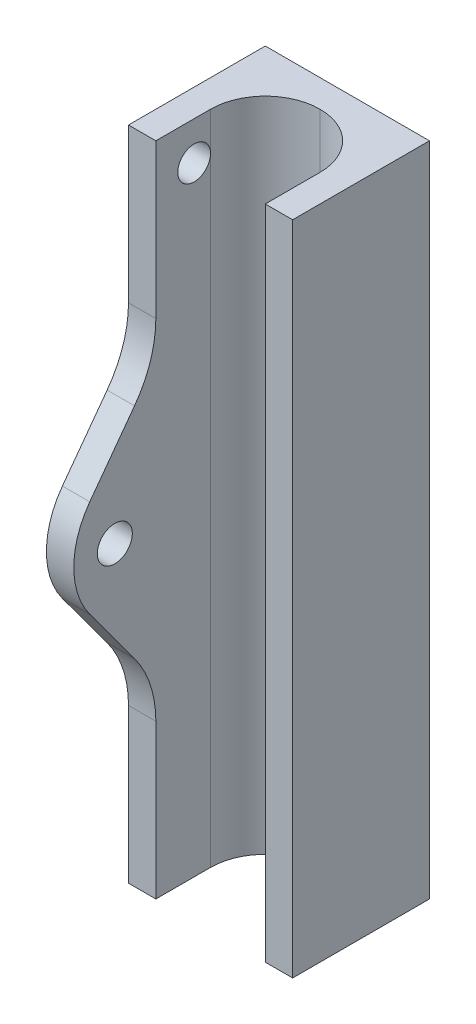
ISO-10303-21;
HEADER;
FILE_DESCRIPTION(('STEP AP214'),'2;1');
FILE_NAME('part.step','',(''),(''),'','','');
FILE_SCHEMA(('AUTOMOTIVE_DESIGN { 1 0 10303 214 1 1 1 1 }'));
ENDSEC;
DATA;
#1=APPLICATION_CONTEXT('core data for automotive mechanical design processes');
#2=APPLICATION_PROTOCOL_DEFINITION('international standard','automotive_design',2000,#1);
#3=PRODUCT_CONTEXT('',#1,'mechanical');
#4=PRODUCT('Part','Part','',(#3));
#5=PRODUCT_RELATED_PRODUCT_CATEGORY('part','',(#4));
#6=PRODUCT_DEFINITION_FORMATION('','',#4);
#7=PRODUCT_DEFINITION_CONTEXT('part definition',#1,'design');
#8=PRODUCT_DEFINITION('design','',#6,#7);
#9=PRODUCT_DEFINITION_SHAPE('','',#8);
#10=(LENGTH_UNIT() NAMED_UNIT(*) SI_UNIT(.MILLI.,.METRE.));
#11=(NAMED_UNIT(*) PLANE_ANGLE_UNIT() SI_UNIT($,.RADIAN.));
#12=(NAMED_UNIT(*) SI_UNIT($,.STERADIAN.) SOLID_ANGLE_UNIT());
#13=UNCERTAINTY_MEASURE_WITH_UNIT(LENGTH_MEASURE(1.E-05),#10,'distance_accuracy_value','');
#14=(GEOMETRIC_REPRESENTATION_CONTEXT(3) GLOBAL_UNCERTAINTY_ASSIGNED_CONTEXT((#13)) GLOBAL_UNIT_ASSIGNED_CONTEXT((#10,
#11,#12)) REPRESENTATION_CONTEXT('',''));
#15=CARTESIAN_POINT('',(0.,0.,0.));
#16=DIRECTION('',(0.,0.,1.));
#17=DIRECTION('',(1.,0.,0.));
#18=AXIS2_PLACEMENT_3D('',#15,#16,#17);
#19=CARTESIAN_POINT('',(-6.35,0.,12.7));
#20=DIRECTION('',(1.,0.,0.));
#21=DIRECTION('',(0.,0.,-1.));
#22=AXIS2_PLACEMENT_3D('',#19,#20,#21);
#23=PLANE('',#22);
#24=CARTESIAN_POINT('',(-6.35,0.,17.4625));
#25=DIRECTION('',(1.,0.,0.));
#26=DIRECTION('',(0.,0.,-1.));
#27=AXIS2_PLACEMENT_3D('',#24,#25,#26);
#28=CIRCLE('',#27,2.032);
#29=CARTESIAN_POINT('',(-6.35,0.,15.4305));
#30=VERTEX_POINT('',#29);
#31=EDGE_CURVE('E363',#30,#30,#28,.T.);
#32=ORIENTED_EDGE('',*,*,#31,.F.);
#33=EDGE_LOOP('',(#32));
#34=FACE_BOUND('',#33,.T.);
#35=DIRECTION('',(0.,-1.,0.));
#36=VECTOR('',#35,1.);
#37=CARTESIAN_POINT('',(-6.35,38.1,6.35));
#38=LINE('',#37,#36);
#39=CARTESIAN_POINT('',(-6.35,-38.1,6.35));
#40=VERTEX_POINT('',#39);
#41=CARTESIAN_POINT('',(-6.35,33.655,6.35));
#42=VERTEX_POINT('',#41);
#43=EDGE_CURVE('E465',#40,#42,#38,.F.);
#44=ORIENTED_EDGE('',*,*,#43,.T.);
#45=CARTESIAN_POINT('',(-6.35,33.655,8.255));
#46=DIRECTION('',(1.,0.,0.));
#47=DIRECTION('',(0.,0.,-1.));
#48=AXIS2_PLACEMENT_3D('',#45,#46,#47);
#49=CIRCLE('',#48,1.905);
#50=EDGE_CURVE('E213',#42,#42,#49,.F.);
#51=ORIENTED_EDGE('',*,*,#50,.T.);
#52=CARTESIAN_POINT('',(-6.35,38.1,6.35));
#53=VERTEX_POINT('',#52);
#54=EDGE_CURVE('E464',#42,#53,#38,.F.);
#55=ORIENTED_EDGE('',*,*,#54,.T.);
#56=DIRECTION('',(0.,0.,-1.));
#57=VECTOR('',#56,1.);
#58=CARTESIAN_POINT('',(-6.35,38.1,12.7));
#59=LINE('',#58,#57);
#60=CARTESIAN_POINT('',(-6.35000000000001,38.1,12.7));
#61=VERTEX_POINT('',#60);
#62=EDGE_CURVE('E461',#61,#53,#59,.T.);
#63=ORIENTED_EDGE('',*,*,#62,.F.);
#64=DIRECTION('',(0.,-1.,0.));
#65=VECTOR('',#64,1.);
#66=CARTESIAN_POINT('',(-6.35,0.,12.7));
#67=LINE('',#66,#65);
#68=CARTESIAN_POINT('',(-6.35000000000001,20.2324014238191,12.7));
#69=VERTEX_POINT('',#68);
#70=EDGE_CURVE('E403',#61,#69,#67,.T.);
#71=ORIENTED_EDGE('',*,*,#70,.T.);
#72=CARTESIAN_POINT('',(-6.35,20.2324014238191,25.4));
#73=DIRECTION('',(1.,0.,0.));
#74=DIRECTION('',(0.,0.,-1.));
#75=AXIS2_PLACEMENT_3D('',#72,#73,#74);
#76=CIRCLE('',#75,12.7);
#77=CARTESIAN_POINT('',(-6.35000000000001,12.7,15.1748873458309));
#78=VERTEX_POINT('',#77);
#79=EDGE_CURVE('E399',#69,#78,#76,.F.);
#80=ORIENTED_EDGE('',*,*,#79,.T.);
#81=DIRECTION('',(0.,0.805126980643237,-0.593102474316458));
#82=VECTOR('',#81,1.);
#83=CARTESIAN_POINT('',(-6.35,5.64930106786428,20.3688344906269));
#84=LINE('',#83,#82);
#85=CARTESIAN_POINT('',(-6.35000000000001,5.64930106786431,20.3688344906268));
#86=VERTEX_POINT('',#85);
#87=EDGE_CURVE('E407',#86,#78,#84,.T.);
#88=ORIENTED_EDGE('',*,*,#87,.F.);
#89=CARTESIAN_POINT('',(-6.35,0.,12.7));
#90=DIRECTION('',(1.,0.,0.));
#91=DIRECTION('',(0.,0.,-1.));
#92=AXIS2_PLACEMENT_3D('',#89,#90,#91);
#93=CIRCLE('',#92,9.525);
#94=CARTESIAN_POINT('',(-6.35000000000001,-5.64930106786427,20.3688344906268));
#95=VERTEX_POINT('',#94);
#96=EDGE_CURVE('E385',#86,#95,#93,.T.);
#97=ORIENTED_EDGE('',*,*,#96,.T.);
#98=DIRECTION('',(0.,-0.805126980643237,-0.593102474316458));
#99=VECTOR('',#98,1.);
#100=CARTESIAN_POINT('',(-6.35,-5.64930106786427,20.3688344906268));
#101=LINE('',#100,#99);
#102=CARTESIAN_POINT('',(-6.35000000000001,-12.7,15.1748873458309));
#103=VERTEX_POINT('',#102);
#104=EDGE_CURVE('E359',#95,#103,#101,.T.);
#105=ORIENTED_EDGE('',*,*,#104,.T.);
#106=CARTESIAN_POINT('',(-6.35,-20.232401423819,25.4));
#107=DIRECTION('',(1.,0.,0.));
#108=DIRECTION('',(0.,0.,-1.));
#109=AXIS2_PLACEMENT_3D('',#106,#107,#108);
#110=CIRCLE('',#109,12.7);
#111=CARTESIAN_POINT('',(-6.35000000000001,-20.232401423819,12.7));
#112=VERTEX_POINT('',#111);
#113=EDGE_CURVE('E348',#112,#103,#110,.T.);
#114=ORIENTED_EDGE('',*,*,#113,.F.);
#115=DIRECTION('',(0.,-1.,0.));
#116=VECTOR('',#115,1.);
#117=CARTESIAN_POINT('',(-6.35,0.,12.7));
#118=LINE('',#117,#116);
#119=CARTESIAN_POINT('',(-6.35000000000001,-38.1,12.7));
#120=VERTEX_POINT('',#119);
#121=EDGE_CURVE('E315',#112,#120,#118,.T.);
#122=ORIENTED_EDGE('',*,*,#121,.T.);
#123=DIRECTION('',(0.,0.,-1.));
#124=VECTOR('',#123,1.);
#125=CARTESIAN_POINT('',(-6.35,-38.1,12.7));
#126=LINE('',#125,#124);
#127=EDGE_CURVE('E450',#120,#40,#126,.T.);
#128=ORIENTED_EDGE('',*,*,#127,.T.);
#129=EDGE_LOOP('',(#44,#51,#55,#63,#71,#80,#88,#97,#105,#114,#122,#128));
#130=FACE_BOUND('',#129,.T.);
#131=ADVANCED_FACE('F198',(#34,#130),#23,.T.);
#132=CARTESIAN_POINT('',(-9.52500000000001,0.,12.7));
#133=DIRECTION('',(1.,0.,0.));
#134=DIRECTION('',(0.,1.,0.));
#135=AXIS2_PLACEMENT_3D('',#132,#133,#134);
#136=PLANE('',#135);
#137=CARTESIAN_POINT('',(-9.52500000000001,33.655,8.255));
#138=DIRECTION('',(-1.,0.,0.));
#139=DIRECTION('',(0.,-1.,0.));
#140=AXIS2_PLACEMENT_3D('',#137,#138,#139);
#141=CIRCLE('',#140,1.905);
#142=CARTESIAN_POINT('',(-9.52500000000001,31.75,8.255));
#143=VERTEX_POINT('',#142);
#144=EDGE_CURVE('E736',#143,#143,#141,.T.);
#145=ORIENTED_EDGE('',*,*,#144,.F.);
#146=EDGE_LOOP('',(#145));
#147=FACE_BOUND('',#146,.T.);
#148=CARTESIAN_POINT('',(-9.52500000000001,0.,17.4625));
#149=DIRECTION('',(1.,0.,0.));
#150=DIRECTION('',(0.,0.,-1.));
#151=AXIS2_PLACEMENT_3D('',#148,#149,#150);
#152=CIRCLE('',#151,2.032);
#153=CARTESIAN_POINT('',(-9.52500000000001,0.,15.4305));
#154=VERTEX_POINT('',#153);
#155=EDGE_CURVE('E336',#154,#154,#152,.T.);
#156=ORIENTED_EDGE('',*,*,#155,.T.);
#157=EDGE_LOOP('',(#156));
#158=FACE_BOUND('',#157,.T.);
#159=DIRECTION('',(0.,-1.,0.));
#160=VECTOR('',#159,1.);
#161=CARTESIAN_POINT('',(-9.52500000000001,0.,12.7));
#162=LINE('',#161,#160);
#163=CARTESIAN_POINT('',(-9.52500000000001,-20.232401423819,12.7));
#164=VERTEX_POINT('',#163);
#165=CARTESIAN_POINT('',(-9.52500000000001,-38.1,12.7));
#166=VERTEX_POINT('',#165);
#167=EDGE_CURVE('E312',#164,#166,#162,.T.);
#168=ORIENTED_EDGE('',*,*,#167,.F.);
#169=CARTESIAN_POINT('',(-9.52500000000001,-20.232401423819,25.4));
#170=DIRECTION('',(1.,0.,0.));
#171=DIRECTION('',(0.,0.,-1.));
#172=AXIS2_PLACEMENT_3D('',#169,#170,#171);
#173=CIRCLE('',#172,12.7);
#174=CARTESIAN_POINT('',(-9.52500000000001,-12.7,15.1748873458309));
#175=VERTEX_POINT('',#174);
#176=EDGE_CURVE('E324',#164,#175,#173,.T.);
#177=ORIENTED_EDGE('',*,*,#176,.T.);
#178=DIRECTION('',(0.,-0.805126980643237,-0.593102474316458));
#179=VECTOR('',#178,1.);
#180=CARTESIAN_POINT('',(-9.52500000000001,-11.7138406832165,15.901348568615));
#181=LINE('',#180,#179);
#182=CARTESIAN_POINT('',(-9.52500000000001,-5.64930106786427,20.3688344906268));
#183=VERTEX_POINT('',#182);
#184=EDGE_CURVE('E320',#183,#175,#181,.T.);
#185=ORIENTED_EDGE('',*,*,#184,.F.);
#186=CARTESIAN_POINT('',(-9.52500000000001,0.,12.7));
#187=DIRECTION('',(1.,0.,0.));
#188=DIRECTION('',(0.,0.,-1.));
#189=AXIS2_PLACEMENT_3D('',#186,#187,#188);
#190=CIRCLE('',#189,9.525);
#191=CARTESIAN_POINT('',(-9.52500000000001,5.64930106786431,20.3688344906268));
#192=VERTEX_POINT('',#191);
#193=EDGE_CURVE('E373',#192,#183,#190,.T.);
#194=ORIENTED_EDGE('',*,*,#193,.F.);
#195=DIRECTION('',(0.,0.805126980643237,-0.593102474316458));
#196=VECTOR('',#195,1.);
#197=CARTESIAN_POINT('',(-9.52500000000001,11.7138406832165,15.901348568615));
#198=LINE('',#197,#196);
#199=CARTESIAN_POINT('',(-9.52500000000001,12.7,15.1748873458309));
#200=VERTEX_POINT('',#199);
#201=EDGE_CURVE('E376',#192,#200,#198,.T.);
#202=ORIENTED_EDGE('',*,*,#201,.T.);
#203=CARTESIAN_POINT('',(-9.52500000000001,20.2324014238191,25.4));
#204=DIRECTION('',(1.,0.,0.));
#205=DIRECTION('',(0.,0.,-1.));
#206=AXIS2_PLACEMENT_3D('',#203,#204,#205);
#207=CIRCLE('',#206,12.7);
#208=CARTESIAN_POINT('',(-9.52500000000001,20.2324014238191,12.7));
#209=VERTEX_POINT('',#208);
#210=EDGE_CURVE('E367',#209,#200,#207,.F.);
#211=ORIENTED_EDGE('',*,*,#210,.F.);
#212=DIRECTION('',(0.,-1.,0.));
#213=VECTOR('',#212,1.);
#214=CARTESIAN_POINT('',(-9.52500000000001,0.,12.7));
#215=LINE('',#214,#213);
#216=CARTESIAN_POINT('',(-9.52500000000001,38.1,12.7));
#217=VERTEX_POINT('',#216);
#218=EDGE_CURVE('E370',#217,#209,#215,.T.);
#219=ORIENTED_EDGE('',*,*,#218,.F.);
#220=DIRECTION('',(0.,0.,-1.));
#221=VECTOR('',#220,1.);
#222=CARTESIAN_POINT('',(-9.52500000000001,38.1,12.7));
#223=LINE('',#222,#221);
#224=CARTESIAN_POINT('',(-9.52500000000001,38.1,-3.175));
#225=VERTEX_POINT('',#224);
#226=EDGE_CURVE('E458',#217,#225,#223,.T.);
#227=ORIENTED_EDGE('',*,*,#226,.T.);
#228=DIRECTION('',(0.,-1.,0.));
#229=VECTOR('',#228,1.);
#230=CARTESIAN_POINT('',(-9.52500000000001,0.,-3.175));
#231=LINE('',#230,#229);
#232=CARTESIAN_POINT('',(-9.525,-38.1,-3.175));
#233=VERTEX_POINT('',#232);
#234=EDGE_CURVE('E436',#225,#233,#231,.T.);
#235=ORIENTED_EDGE('',*,*,#234,.T.);
#236=DIRECTION('',(0.,0.,-1.));
#237=VECTOR('',#236,1.);
#238=CARTESIAN_POINT('',(-9.525,-38.1,12.7));
#239=LINE('',#238,#237);
#240=EDGE_CURVE('E334',#166,#233,#239,.T.);
#241=ORIENTED_EDGE('',*,*,#240,.F.);
#242=EDGE_LOOP('',(#168,#177,#185,#194,#202,#211,#219,#227,#235,#241));
#243=FACE_BOUND('',#242,.T.);
#244=ADVANCED_FACE('F332',(#147,#158,#243),#136,.F.);
#245=CARTESIAN_POINT('',(0.,-38.1,12.7));
#246=DIRECTION('',(0.,1.,0.));
#247=DIRECTION('',(0.,0.,1.));
#248=AXIS2_PLACEMENT_3D('',#245,#246,#247);
#249=PLANE('',#248);
#250=DIRECTION('',(1.,0.,0.));
#251=VECTOR('',#250,1.);
#252=CARTESIAN_POINT('',(-9.52500000000001,-38.1,12.7));
#253=LINE('',#252,#251);
#254=EDGE_CURVE('E345',#166,#120,#253,.T.);
#255=ORIENTED_EDGE('',*,*,#254,.F.);
#256=ORIENTED_EDGE('',*,*,#240,.T.);
#257=DIRECTION('',(1.,0.,0.));
#258=VECTOR('',#257,1.);
#259=CARTESIAN_POINT('',(0.,-38.1,-3.175));
#260=LINE('',#259,#258);
#261=CARTESIAN_POINT('',(9.525,-38.1,-3.175));
#262=VERTEX_POINT('',#261);
#263=EDGE_CURVE('E439',#233,#262,#260,.T.);
#264=ORIENTED_EDGE('',*,*,#263,.T.);
#265=DIRECTION('',(0.,0.,1.));
#266=VECTOR('',#265,1.);
#267=CARTESIAN_POINT('',(9.525,-38.1,-3.175));
#268=LINE('',#267,#266);
#269=CARTESIAN_POINT('',(9.525,-38.1,12.7));
#270=VERTEX_POINT('',#269);
#271=EDGE_CURVE('E446',#262,#270,#268,.T.);
#272=ORIENTED_EDGE('',*,*,#271,.T.);
#273=DIRECTION('',(1.,0.,0.));
#274=VECTOR('',#273,1.);
#275=CARTESIAN_POINT('',(0.,-38.1,12.7));
#276=LINE('',#275,#274);
#277=CARTESIAN_POINT('',(6.35,-38.1,12.7));
#278=VERTEX_POINT('',#277);
#279=EDGE_CURVE('E417',#278,#270,#276,.T.);
#280=ORIENTED_EDGE('',*,*,#279,.F.);
#281=DIRECTION('',(0.,0.,-1.));
#282=VECTOR('',#281,1.);
#283=CARTESIAN_POINT('',(6.35,-38.1,12.7));
#284=LINE('',#283,#282);
#285=CARTESIAN_POINT('',(6.35,-38.1,6.35));
#286=VERTEX_POINT('',#285);
#287=EDGE_CURVE('E424',#278,#286,#284,.T.);
#288=ORIENTED_EDGE('',*,*,#287,.T.);
#289=CARTESIAN_POINT('',(0.,-38.1,6.35));
#290=DIRECTION('',(0.,1.,0.));
#291=DIRECTION('',(0.,0.,1.));
#292=AXIS2_PLACEMENT_3D('',#289,#290,#291);
#293=CIRCLE('',#292,6.35);
#294=CARTESIAN_POINT('',(0.,-38.1,0.));
#295=VERTEX_POINT('',#294);
#296=EDGE_CURVE('E208',#286,#295,#293,.T.);
#297=ORIENTED_EDGE('',*,*,#296,.T.);
#298=CARTESIAN_POINT('',(0.,-38.1,6.35));
#299=DIRECTION('',(0.,1.,0.));
#300=DIRECTION('',(0.,0.,1.));
#301=AXIS2_PLACEMENT_3D('',#298,#299,#300);
#302=CIRCLE('',#301,6.35);
#303=EDGE_CURVE('E472',#295,#40,#302,.T.);
#304=ORIENTED_EDGE('',*,*,#303,.T.);
#305=ORIENTED_EDGE('',*,*,#127,.F.);
#306=EDGE_LOOP('',(#255,#256,#264,#272,#280,#288,#297,#304,#305));
#307=FACE_BOUND('',#306,.T.);
#308=ADVANCED_FACE('F482',(#307),#249,.F.);
#309=CARTESIAN_POINT('',(0.,38.1,12.7));
#310=DIRECTION('',(0.,1.,0.));
#311=DIRECTION('',(0.,0.,1.));
#312=AXIS2_PLACEMENT_3D('',#309,#310,#311);
#313=PLANE('',#312);
#314=ORIENTED_EDGE('',*,*,#226,.F.);
#315=DIRECTION('',(1.,0.,0.));
#316=VECTOR('',#315,1.);
#317=CARTESIAN_POINT('',(-9.52500000000001,38.1,12.7));
#318=LINE('',#317,#316);
#319=EDGE_CURVE('E390',#217,#61,#318,.T.);
#320=ORIENTED_EDGE('',*,*,#319,.T.);
#321=ORIENTED_EDGE('',*,*,#62,.T.);
#322=CARTESIAN_POINT('',(0.,38.1,6.35));
#323=DIRECTION('',(0.,1.,0.));
#324=DIRECTION('',(0.,0.,1.));
#325=AXIS2_PLACEMENT_3D('',#322,#323,#324);
#326=CIRCLE('',#325,6.35);
#327=CARTESIAN_POINT('',(0.,38.1,0.));
#328=VERTEX_POINT('',#327);
#329=EDGE_CURVE('E219',#53,#328,#326,.F.);
#330=ORIENTED_EDGE('',*,*,#329,.T.);
#331=CARTESIAN_POINT('',(0.,38.1,6.35));
#332=DIRECTION('',(0.,1.,0.));
#333=DIRECTION('',(0.,0.,1.));
#334=AXIS2_PLACEMENT_3D('',#331,#332,#333);
#335=CIRCLE('',#334,6.35);
#336=CARTESIAN_POINT('',(6.35,38.1,6.35));
#337=VERTEX_POINT('',#336);
#338=EDGE_CURVE('E12',#328,#337,#335,.F.);
#339=ORIENTED_EDGE('',*,*,#338,.T.);
#340=DIRECTION('',(0.,0.,-1.));
#341=VECTOR('',#340,1.);
#342=CARTESIAN_POINT('',(6.35,38.1,12.7));
#343=LINE('',#342,#341);
#344=CARTESIAN_POINT('',(6.35,38.1,12.7));
#345=VERTEX_POINT('',#344);
#346=EDGE_CURVE('E428',#345,#337,#343,.T.);
#347=ORIENTED_EDGE('',*,*,#346,.F.);
#348=DIRECTION('',(1.,0.,0.));
#349=VECTOR('',#348,1.);
#350=CARTESIAN_POINT('',(0.,38.1,12.7));
#351=LINE('',#350,#349);
#352=CARTESIAN_POINT('',(9.52499999999999,38.1,12.7));
#353=VERTEX_POINT('',#352);
#354=EDGE_CURVE('E410',#345,#353,#351,.T.);
#355=ORIENTED_EDGE('',*,*,#354,.T.);
#356=DIRECTION('',(0.,0.,1.));
#357=VECTOR('',#356,1.);
#358=CARTESIAN_POINT('',(9.52499999999999,38.1,-3.175));
#359=LINE('',#358,#357);
#360=CARTESIAN_POINT('',(9.52499999999999,38.1,-3.175));
#361=VERTEX_POINT('',#360);
#362=EDGE_CURVE('E447',#361,#353,#359,.T.);
#363=ORIENTED_EDGE('',*,*,#362,.F.);
#364=DIRECTION('',(1.,0.,0.));
#365=VECTOR('',#364,1.);
#366=CARTESIAN_POINT('',(0.,38.1,-3.175));
#367=LINE('',#366,#365);
#368=EDGE_CURVE('E432',#225,#361,#367,.T.);
#369=ORIENTED_EDGE('',*,*,#368,.F.);
#370=EDGE_LOOP('',(#314,#320,#321,#330,#339,#347,#355,#363,#369));
#371=FACE_BOUND('',#370,.T.);
#372=ADVANCED_FACE('F506',(#371),#313,.T.);
#373=CARTESIAN_POINT('',(9.525,0.,-3.175));
#374=DIRECTION('',(-1.,0.,0.));
#375=DIRECTION('',(0.,-1.,0.));
#376=AXIS2_PLACEMENT_3D('',#373,#374,#375);
#377=PLANE('',#376);
#378=ORIENTED_EDGE('',*,*,#362,.T.);
#379=DIRECTION('',(0.,-1.,0.));
#380=VECTOR('',#379,1.);
#381=CARTESIAN_POINT('',(9.525,0.,12.7));
#382=LINE('',#381,#380);
#383=EDGE_CURVE('E421',#353,#270,#382,.T.);
#384=ORIENTED_EDGE('',*,*,#383,.T.);
#385=ORIENTED_EDGE('',*,*,#271,.F.);
#386=DIRECTION('',(0.,-1.,0.));
#387=VECTOR('',#386,1.);
#388=CARTESIAN_POINT('',(9.525,0.,-3.175));
#389=LINE('',#388,#387);
#390=EDGE_CURVE('E443',#361,#262,#389,.T.);
#391=ORIENTED_EDGE('',*,*,#390,.F.);
#392=EDGE_LOOP('',(#378,#384,#385,#391));
#393=FACE_BOUND('',#392,.T.);
#394=ADVANCED_FACE('F510',(#393),#377,.F.);
#395=CARTESIAN_POINT('',(0.,0.,-3.175));
#396=DIRECTION('',(0.,0.,1.));
#397=DIRECTION('',(1.,0.,0.));
#398=AXIS2_PLACEMENT_3D('',#395,#396,#397);
#399=PLANE('',#398);
#400=ORIENTED_EDGE('',*,*,#368,.T.);
#401=ORIENTED_EDGE('',*,*,#390,.T.);
#402=ORIENTED_EDGE('',*,*,#263,.F.);
#403=ORIENTED_EDGE('',*,*,#234,.F.);
#404=EDGE_LOOP('',(#400,#401,#402,#403));
#405=FACE_BOUND('',#404,.T.);
#406=ADVANCED_FACE('F499',(#405),#399,.F.);
#407=CARTESIAN_POINT('',(6.35,0.,12.7));
#408=DIRECTION('',(1.,0.,0.));
#409=DIRECTION('',(0.,0.,-1.));
#410=AXIS2_PLACEMENT_3D('',#407,#408,#409);
#411=PLANE('',#410);
#412=ORIENTED_EDGE('',*,*,#346,.T.);
#413=DIRECTION('',(0.,-1.,0.));
#414=VECTOR('',#413,1.);
#415=CARTESIAN_POINT('',(6.35,0.,6.35));
#416=LINE('',#415,#414);
#417=EDGE_CURVE('E469',#337,#286,#416,.T.);
#418=ORIENTED_EDGE('',*,*,#417,.T.);
#419=ORIENTED_EDGE('',*,*,#287,.F.);
#420=DIRECTION('',(0.,-1.,0.));
#421=VECTOR('',#420,1.);
#422=CARTESIAN_POINT('',(6.35,0.,12.7));
#423=LINE('',#422,#421);
#424=EDGE_CURVE('E414',#345,#278,#423,.T.);
#425=ORIENTED_EDGE('',*,*,#424,.F.);
#426=EDGE_LOOP('',(#412,#418,#419,#425));
#427=FACE_BOUND('',#426,.T.);
#428=ADVANCED_FACE('F515',(#427),#411,.F.);
#429=CARTESIAN_POINT('',(0.,0.,12.7));
#430=DIRECTION('',(0.,0.,1.));
#431=DIRECTION('',(1.,0.,0.));
#432=AXIS2_PLACEMENT_3D('',#429,#430,#431);
#433=PLANE('',#432);
#434=ORIENTED_EDGE('',*,*,#279,.T.);
#435=ORIENTED_EDGE('',*,*,#383,.F.);
#436=ORIENTED_EDGE('',*,*,#354,.F.);
#437=ORIENTED_EDGE('',*,*,#424,.T.);
#438=EDGE_LOOP('',(#434,#435,#436,#437));
#439=FACE_BOUND('',#438,.T.);
#440=ADVANCED_FACE('F512',(#439),#433,.T.);
#441=CARTESIAN_POINT('',(0.,0.,6.35));
#442=DIRECTION('',(0.,-1.,0.));
#443=DIRECTION('',(0.,0.,-1.));
#444=AXIS2_PLACEMENT_3D('',#441,#442,#443);
#445=CYLINDRICAL_SURFACE('',#444,6.35);
#446=ORIENTED_EDGE('',*,*,#417,.F.);
#447=ORIENTED_EDGE('',*,*,#338,.F.);
#448=DIRECTION('',(0.,-1.,0.));
#449=VECTOR('',#448,1.);
#450=CARTESIAN_POINT('',(0.,0.,0.));
#451=LINE('',#450,#449);
#452=EDGE_CURVE('E202',#295,#328,#451,.F.);
#453=ORIENTED_EDGE('',*,*,#452,.F.);
#454=ORIENTED_EDGE('',*,*,#296,.F.);
#455=EDGE_LOOP('',(#446,#447,#453,#454));
#456=FACE_BOUND('',#455,.T.);
#457=ADVANCED_FACE('F200',(#456),#445,.F.);
#458=CARTESIAN_POINT('',(0.,0.,6.35));
#459=DIRECTION('',(0.,1.,0.));
#460=DIRECTION('',(0.,0.,1.));
#461=AXIS2_PLACEMENT_3D('',#458,#459,#460);
#462=CYLINDRICAL_SURFACE('',#461,6.35);
#463=ORIENTED_EDGE('',*,*,#329,.F.);
#464=ORIENTED_EDGE('',*,*,#54,.F.);
#465=ORIENTED_EDGE('',*,*,#43,.F.);
#466=ORIENTED_EDGE('',*,*,#303,.F.);
#467=ORIENTED_EDGE('',*,*,#452,.T.);
#468=EDGE_LOOP('',(#463,#464,#465,#466,#467));
#469=FACE_BOUND('',#468,.T.);
#470=ADVANCED_FACE('F493',(#469),#462,.F.);
#471=CARTESIAN_POINT('',(-9.52500000000001,20.2324014238191,25.4));
#472=DIRECTION('',(1.,0.,0.));
#473=DIRECTION('',(0.,0.,-1.));
#474=AXIS2_PLACEMENT_3D('',#471,#472,#473);
#475=CYLINDRICAL_SURFACE('',#474,12.7);
#476=DIRECTION('',(1.,0.,0.));
#477=VECTOR('',#476,1.);
#478=CARTESIAN_POINT('',(-9.52500000000001,20.2324014238191,12.7));
#479=LINE('',#478,#477);
#480=EDGE_CURVE('E380',#209,#69,#479,.T.);
#481=ORIENTED_EDGE('',*,*,#480,.F.);
#482=ORIENTED_EDGE('',*,*,#210,.T.);
#483=DIRECTION('',(1.,0.,0.));
#484=VECTOR('',#483,1.);
#485=CARTESIAN_POINT('',(-9.52500000000001,12.7,15.1748873458309));
#486=LINE('',#485,#484);
#487=EDGE_CURVE('E381',#200,#78,#486,.T.);
#488=ORIENTED_EDGE('',*,*,#487,.T.);
#489=ORIENTED_EDGE('',*,*,#79,.F.);
#490=EDGE_LOOP('',(#481,#482,#488,#489));
#491=FACE_BOUND('',#490,.T.);
#492=ADVANCED_FACE('F536',(#491),#475,.F.);
#493=CARTESIAN_POINT('',(-9.52500000000001,11.7138406832165,15.901348568615));
#494=DIRECTION('',(0.,-0.593102474316458,-0.805126980643237));
#495=DIRECTION('',(0.,0.805126980643237,-0.593102474316458));
#496=AXIS2_PLACEMENT_3D('',#493,#494,#495);
#497=PLANE('',#496);
#498=ORIENTED_EDGE('',*,*,#87,.T.);
#499=ORIENTED_EDGE('',*,*,#487,.F.);
#500=ORIENTED_EDGE('',*,*,#201,.F.);
#501=DIRECTION('',(1.,0.,0.));
#502=VECTOR('',#501,1.);
#503=CARTESIAN_POINT('',(-9.52500000000001,5.64930106786431,20.3688344906268));
#504=LINE('',#503,#502);
#505=EDGE_CURVE('E386',#192,#86,#504,.T.);
#506=ORIENTED_EDGE('',*,*,#505,.T.);
#507=EDGE_LOOP('',(#498,#499,#500,#506));
#508=FACE_BOUND('',#507,.T.);
#509=ADVANCED_FACE('F541',(#508),#497,.F.);
#510=CARTESIAN_POINT('',(-9.52500000000001,0.,12.7));
#511=DIRECTION('',(1.,0.,0.));
#512=DIRECTION('',(0.,0.,-1.));
#513=AXIS2_PLACEMENT_3D('',#510,#511,#512);
#514=CYLINDRICAL_SURFACE('',#513,9.525);
#515=ORIENTED_EDGE('',*,*,#505,.F.);
#516=ORIENTED_EDGE('',*,*,#193,.T.);
#517=DIRECTION('',(1.,0.,0.));
#518=VECTOR('',#517,1.);
#519=CARTESIAN_POINT('',(-9.52500000000001,-5.64930106786427,20.3688344906268));
#520=LINE('',#519,#518);
#521=EDGE_CURVE('E349',#183,#95,#520,.T.);
#522=ORIENTED_EDGE('',*,*,#521,.T.);
#523=ORIENTED_EDGE('',*,*,#96,.F.);
#524=EDGE_LOOP('',(#515,#516,#522,#523));
#525=FACE_BOUND('',#524,.T.);
#526=ADVANCED_FACE('F566',(#525),#514,.T.);
#527=CARTESIAN_POINT('',(-9.52500000000001,0.,12.7));
#528=DIRECTION('',(0.,0.,1.));
#529=DIRECTION('',(1.,0.,0.));
#530=AXIS2_PLACEMENT_3D('',#527,#528,#529);
#531=PLANE('',#530);
#532=ORIENTED_EDGE('',*,*,#319,.F.);
#533=ORIENTED_EDGE('',*,*,#218,.T.);
#534=ORIENTED_EDGE('',*,*,#480,.T.);
#535=ORIENTED_EDGE('',*,*,#70,.F.);
#536=EDGE_LOOP('',(#532,#533,#534,#535));
#537=FACE_BOUND('',#536,.T.);
#538=ADVANCED_FACE('F574',(#537),#531,.T.);
#539=CARTESIAN_POINT('',(-9.52500000000001,0.,12.7));
#540=DIRECTION('',(0.,0.,1.));
#541=DIRECTION('',(1.,0.,0.));
#542=AXIS2_PLACEMENT_3D('',#539,#540,#541);
#543=PLANE('',#542);
#544=DIRECTION('',(1.,0.,0.));
#545=VECTOR('',#544,1.);
#546=CARTESIAN_POINT('',(-9.52500000000001,-20.232401423819,12.7));
#547=LINE('',#546,#545);
#548=EDGE_CURVE('E308',#164,#112,#547,.T.);
#549=ORIENTED_EDGE('',*,*,#548,.F.);
#550=ORIENTED_EDGE('',*,*,#167,.T.);
#551=ORIENTED_EDGE('',*,*,#254,.T.);
#552=ORIENTED_EDGE('',*,*,#121,.F.);
#553=EDGE_LOOP('',(#549,#550,#551,#552));
#554=FACE_BOUND('',#553,.T.);
#555=ADVANCED_FACE('F310',(#554),#543,.T.);
#556=CARTESIAN_POINT('',(-9.52500000000001,-11.7138406832165,15.901348568615));
#557=DIRECTION('',(0.,-0.593102474316458,0.805126980643237));
#558=DIRECTION('',(0.,-0.805126980643237,-0.593102474316458));
#559=AXIS2_PLACEMENT_3D('',#556,#557,#558);
#560=PLANE('',#559);
#561=ORIENTED_EDGE('',*,*,#521,.F.);
#562=ORIENTED_EDGE('',*,*,#184,.T.);
#563=DIRECTION('',(1.,0.,0.));
#564=VECTOR('',#563,1.);
#565=CARTESIAN_POINT('',(-9.52500000000001,-12.7,15.1748873458309));
#566=LINE('',#565,#564);
#567=EDGE_CURVE('E319',#175,#103,#566,.T.);
#568=ORIENTED_EDGE('',*,*,#567,.T.);
#569=ORIENTED_EDGE('',*,*,#104,.F.);
#570=EDGE_LOOP('',(#561,#562,#568,#569));
#571=FACE_BOUND('',#570,.T.);
#572=ADVANCED_FACE('F589',(#571),#560,.T.);
#573=CARTESIAN_POINT('',(-9.52500000000001,-20.232401423819,25.4));
#574=DIRECTION('',(1.,0.,0.));
#575=DIRECTION('',(0.,0.,-1.));
#576=AXIS2_PLACEMENT_3D('',#573,#574,#575);
#577=CYLINDRICAL_SURFACE('',#576,12.7);
#578=ORIENTED_EDGE('',*,*,#113,.T.);
#579=ORIENTED_EDGE('',*,*,#567,.F.);
#580=ORIENTED_EDGE('',*,*,#176,.F.);
#581=ORIENTED_EDGE('',*,*,#548,.T.);
#582=EDGE_LOOP('',(#578,#579,#580,#581));
#583=FACE_BOUND('',#582,.T.);
#584=ADVANCED_FACE('F325',(#583),#577,.F.);
#585=CARTESIAN_POINT('',(-9.52500000000001,0.,17.4625));
#586=DIRECTION('',(1.,0.,0.));
#587=DIRECTION('',(0.,0.,-1.));
#588=AXIS2_PLACEMENT_3D('',#585,#586,#587);
#589=CYLINDRICAL_SURFACE('',#588,2.032);
#590=CARTESIAN_POINT('',(-6.35,0.,15.4305));
#591=CARTESIAN_POINT('',(-6.38307291666667,0.,15.4305));
#592=CARTESIAN_POINT('',(-6.41614583333334,0.,15.4305));
#593=CARTESIAN_POINT('',(-6.48229166666667,0.,15.4305));
#594=CARTESIAN_POINT('',(-6.51536458333334,0.,15.4305));
#595=CARTESIAN_POINT('',(-6.58151041666667,0.,15.4305));
#596=CARTESIAN_POINT('',(-6.61458333333334,0.,15.4305));
#597=CARTESIAN_POINT('',(-6.68072916666667,0.,15.4305));
#598=CARTESIAN_POINT('',(-6.71380208333334,0.,15.4305));
#599=CARTESIAN_POINT('',(-6.77994791666667,0.,15.4305));
#600=CARTESIAN_POINT('',(-6.81302083333334,0.,15.4305));
#601=CARTESIAN_POINT('',(-6.87916666666667,0.,15.4305));
#602=CARTESIAN_POINT('',(-6.91223958333334,0.,15.4305));
#603=CARTESIAN_POINT('',(-6.97838541666667,0.,15.4305));
#604=CARTESIAN_POINT('',(-7.01145833333334,0.,15.4305));
#605=CARTESIAN_POINT('',(-7.07760416666667,0.,15.4305));
#606=CARTESIAN_POINT('',(-7.11067708333334,0.,15.4305));
#607=CARTESIAN_POINT('',(-7.17682291666667,0.,15.4305));
#608=CARTESIAN_POINT('',(-7.20989583333334,0.,15.4305));
#609=CARTESIAN_POINT('',(-7.27604166666667,0.,15.4305));
#610=CARTESIAN_POINT('',(-7.30911458333334,0.,15.4305));
#611=CARTESIAN_POINT('',(-7.37526041666667,0.,15.4305));
#612=CARTESIAN_POINT('',(-7.40833333333334,0.,15.4305));
#613=CARTESIAN_POINT('',(-7.47447916666667,0.,15.4305));
#614=CARTESIAN_POINT('',(-7.50755208333334,0.,15.4305));
#615=CARTESIAN_POINT('',(-7.57369791666667,0.,15.4305));
#616=CARTESIAN_POINT('',(-7.60677083333334,0.,15.4305));
#617=CARTESIAN_POINT('',(-7.67291666666667,0.,15.4305));
#618=CARTESIAN_POINT('',(-7.70598958333334,0.,15.4305));
#619=CARTESIAN_POINT('',(-7.77213541666668,0.,15.4305));
#620=CARTESIAN_POINT('',(-7.80520833333334,0.,15.4305));
#621=CARTESIAN_POINT('',(-7.87135416666668,0.,15.4305));
#622=CARTESIAN_POINT('',(-7.90442708333334,0.,15.4305));
#623=CARTESIAN_POINT('',(-7.97057291666668,0.,15.4305));
#624=CARTESIAN_POINT('',(-8.00364583333334,0.,15.4305));
#625=CARTESIAN_POINT('',(-8.06979166666667,0.,15.4305));
#626=CARTESIAN_POINT('',(-8.10286458333334,0.,15.4305));
#627=CARTESIAN_POINT('',(-8.16901041666668,0.,15.4305));
#628=CARTESIAN_POINT('',(-8.20208333333334,0.,15.4305));
#629=CARTESIAN_POINT('',(-8.26822916666667,0.,15.4305));
#630=CARTESIAN_POINT('',(-8.30130208333334,0.,15.4305));
#631=CARTESIAN_POINT('',(-8.36744791666668,0.,15.4305));
#632=CARTESIAN_POINT('',(-8.40052083333334,0.,15.4305));
#633=CARTESIAN_POINT('',(-8.46666666666668,0.,15.4305));
#634=CARTESIAN_POINT('',(-8.49973958333334,0.,15.4305));
#635=CARTESIAN_POINT('',(-8.56588541666668,0.,15.4305));
#636=CARTESIAN_POINT('',(-8.59895833333334,0.,15.4305));
#637=CARTESIAN_POINT('',(-8.66510416666668,0.,15.4305));
#638=CARTESIAN_POINT('',(-8.69817708333334,0.,15.4305));
#639=CARTESIAN_POINT('',(-8.76432291666668,0.,15.4305));
#640=CARTESIAN_POINT('',(-8.79739583333335,0.,15.4305));
#641=CARTESIAN_POINT('',(-8.86354166666668,0.,15.4305));
#642=CARTESIAN_POINT('',(-8.89661458333334,0.,15.4305));
#643=CARTESIAN_POINT('',(-8.96276041666668,0.,15.4305));
#644=CARTESIAN_POINT('',(-8.99583333333335,0.,15.4305));
#645=CARTESIAN_POINT('',(-9.06197916666668,0.,15.4305));
#646=CARTESIAN_POINT('',(-9.09505208333334,0.,15.4305));
#647=CARTESIAN_POINT('',(-9.16119791666668,0.,15.4305));
#648=CARTESIAN_POINT('',(-9.19427083333334,0.,15.4305));
#649=CARTESIAN_POINT('',(-9.26041666666668,0.,15.4305));
#650=CARTESIAN_POINT('',(-9.29348958333335,0.,15.4305));
#651=CARTESIAN_POINT('',(-9.35963541666668,0.,15.4305));
#652=CARTESIAN_POINT('',(-9.39270833333335,0.,15.4305));
#653=CARTESIAN_POINT('',(-9.45885416666668,0.,15.4305));
#654=CARTESIAN_POINT('',(-9.49192708333334,0.,15.4305));
#655=CARTESIAN_POINT('',(-9.52500000000001,0.,15.4305));
#656=B_SPLINE_CURVE_WITH_KNOTS('',3,(#590,#591,#592,#593,#594,#595,#596,#597,#598,#599,#600,
#601,#602,#603,#604,#605,#606,#607,#608,#609,#610,#611,#612,#613,#614,#615,#616,#617,#618,#619,
#620,#621,#622,#623,#624,#625,#626,#627,#628,#629,#630,#631,#632,#633,#634,#635,#636,#637,#638,
#639,#640,#641,#642,#643,#644,#645,#646,#647,#648,#649,#650,#651,#652,#653,#654,#655),
.UNSPECIFIED.,.F.,.F.,(4,2,2,2,2,2,2,2,2,2,2,2,2,2,2,2,2,2,2,2,2,2,2,2,2,2,2,2,2,2,2,2,4),(0.,
0.0992187500000012,0.198437500000001,0.297656250000001,0.396875000000001,0.496093750000001,
0.595312500000002,0.694531250000002,0.793750000000003,0.892968750000002,0.992187500000003,
1.09140625,1.190625,1.28984375,1.3890625,1.48828125,1.5875,1.68671875,1.7859375,1.88515625,
1.98437500000001,2.08359375,2.1828125,2.28203125000001,2.38125,2.48046875000001,
2.57968750000001,2.67890625000001,2.77812500000001,2.87734375000001,2.97656250000001,
3.07578125000001,3.17500000000001),.UNSPECIFIED.);
#657=EDGE_CURVE('BSEAM603',#30,#154,#656,.T.);
#658=ORIENTED_EDGE('',*,*,#31,.T.);
#659=ORIENTED_EDGE('',*,*,#155,.F.);
#660=ORIENTED_EDGE('',*,*,#657,.T.);
#661=ORIENTED_EDGE('',*,*,#657,.F.);
#662=EDGE_LOOP('',(#658,#660,#659,#661));
#663=FACE_BOUND('',#662,.T.);
#664=ADVANCED_FACE('F603',(#663),#589,.F.);
#665=CARTESIAN_POINT('',(-0.961846327358518,33.655,8.255));
#666=DIRECTION('',(-1.,0.,0.));
#667=DIRECTION('',(0.,-1.,0.));
#668=AXIS2_PLACEMENT_3D('',#665,#666,#667);
#669=CYLINDRICAL_SURFACE('',#668,1.905);
#670=ORIENTED_EDGE('',*,*,#144,.T.);
#671=EDGE_LOOP('',(#670));
#672=FACE_BOUND('',#671,.T.);
#673=ORIENTED_EDGE('',*,*,#50,.F.);
#674=EDGE_LOOP('',(#673));
#675=FACE_BOUND('',#674,.T.);
#676=ADVANCED_FACE('F609',(#672,#675),#669,.F.);
#677=CLOSED_SHELL('',(#131,#244,#308,#372,#394,#406,#428,#440,#457,#470,#492,#509,#526,#538,
#555,#572,#584,#664,#676));
#678=MANIFOLD_SOLID_BREP('B2',#677);
#679=ADVANCED_BREP_SHAPE_REPRESENTATION('',(#18,#678),#14);
#680=SHAPE_DEFINITION_REPRESENTATION(#9,#679);
ENDSEC;
END-ISO-10303-21;
